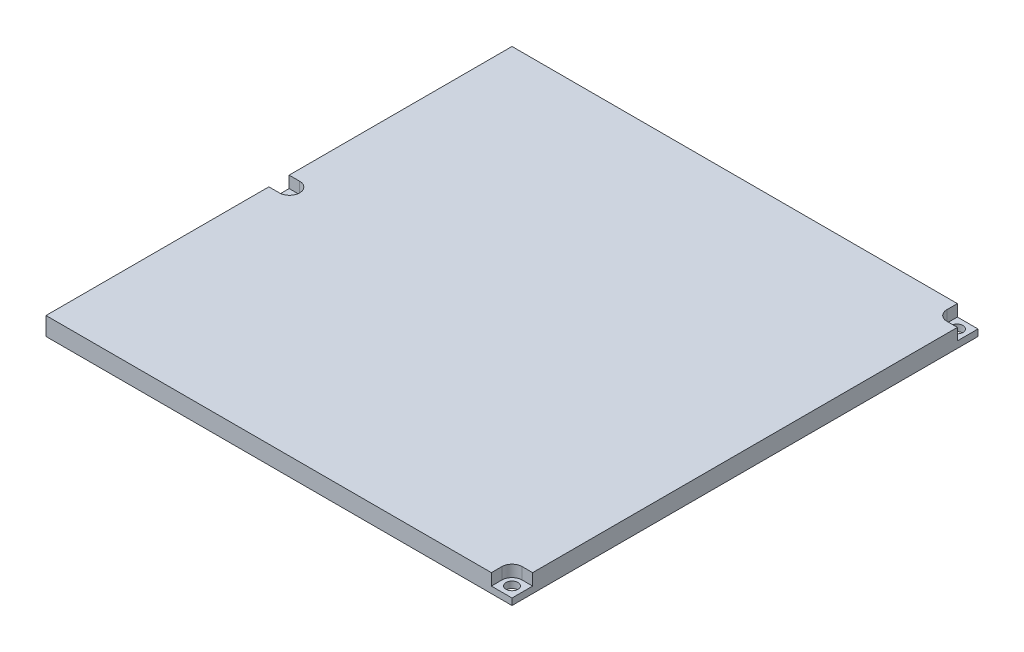
ISO-10303-21;
HEADER;
FILE_DESCRIPTION(('STEP AP214'),'2;1');
FILE_NAME('part.step','',(''),(''),'','','');
FILE_SCHEMA(('AUTOMOTIVE_DESIGN { 1 0 10303 214 1 1 1 1 }'));
ENDSEC;
DATA;
#1=APPLICATION_CONTEXT('core data for automotive mechanical design processes');
#2=APPLICATION_PROTOCOL_DEFINITION('international standard','automotive_design',2000,#1);
#3=PRODUCT_CONTEXT('',#1,'mechanical');
#4=PRODUCT('Part','Part','',(#3));
#5=PRODUCT_RELATED_PRODUCT_CATEGORY('part','',(#4));
#6=PRODUCT_DEFINITION_FORMATION('','',#4);
#7=PRODUCT_DEFINITION_CONTEXT('part definition',#1,'design');
#8=PRODUCT_DEFINITION('design','',#6,#7);
#9=PRODUCT_DEFINITION_SHAPE('','',#8);
#10=(LENGTH_UNIT() NAMED_UNIT(*) SI_UNIT(.MILLI.,.METRE.));
#11=(NAMED_UNIT(*) PLANE_ANGLE_UNIT() SI_UNIT($,.RADIAN.));
#12=(NAMED_UNIT(*) SI_UNIT($,.STERADIAN.) SOLID_ANGLE_UNIT());
#13=UNCERTAINTY_MEASURE_WITH_UNIT(LENGTH_MEASURE(1.E-05),#10,'distance_accuracy_value','');
#14=(GEOMETRIC_REPRESENTATION_CONTEXT(3) GLOBAL_UNCERTAINTY_ASSIGNED_CONTEXT((#13)) GLOBAL_UNIT_ASSIGNED_CONTEXT((#10,
#11,#12)) REPRESENTATION_CONTEXT('',''));
#15=CARTESIAN_POINT('',(0.,0.,0.));
#16=DIRECTION('',(0.,0.,1.));
#17=DIRECTION('',(1.,0.,0.));
#18=AXIS2_PLACEMENT_3D('',#15,#16,#17);
#19=CARTESIAN_POINT('',(4.57200000000001,-0.000999999999999265,-101.6));
#20=DIRECTION('',(0.,1.,0.));
#21=DIRECTION('',(0.,0.,1.));
#22=AXIS2_PLACEMENT_3D('',#19,#20,#21);
#23=CYLINDRICAL_SURFACE('',#22,2.60985);
#24=CARTESIAN_POINT('',(4.57200000000001,0.,-101.6));
#25=DIRECTION('',(0.,-1.,0.));
#26=DIRECTION('',(0.,0.,-1.));
#27=AXIS2_PLACEMENT_3D('',#24,#25,#26);
#28=CIRCLE('',#27,2.60985);
#29=CARTESIAN_POINT('',(4.57200000000001,0.,-104.20985));
#30=VERTEX_POINT('',#29);
#31=EDGE_CURVE('E256',#30,#30,#28,.F.);
#32=ORIENTED_EDGE('',*,*,#31,.F.);
#33=EDGE_LOOP('',(#32));
#34=FACE_BOUND('',#33,.T.);
#35=CARTESIAN_POINT('',(4.57200000000001,2.8575,-101.6));
#36=DIRECTION('',(0.,1.,0.));
#37=DIRECTION('',(0.,0.,1.));
#38=AXIS2_PLACEMENT_3D('',#35,#36,#37);
#39=CIRCLE('',#38,2.60984999999999);
#40=CARTESIAN_POINT('',(4.57200000000001,2.8575,-98.99015));
#41=VERTEX_POINT('',#40);
#42=EDGE_CURVE('E173',#41,#41,#39,.T.);
#43=ORIENTED_EDGE('',*,*,#42,.T.);
#44=EDGE_LOOP('',(#43));
#45=FACE_BOUND('',#44,.T.);
#46=ADVANCED_FACE('F34',(#34,#45),#23,.F.);
#47=CARTESIAN_POINT('',(198.628,-0.000999999999999265,-4.57200000000001));
#48=DIRECTION('',(0.,1.,0.));
#49=DIRECTION('',(0.,0.,1.));
#50=AXIS2_PLACEMENT_3D('',#47,#48,#49);
#51=CYLINDRICAL_SURFACE('',#50,2.60985);
#52=CARTESIAN_POINT('',(198.628,0.,-4.57200000000001));
#53=DIRECTION('',(0.,-1.,0.));
#54=DIRECTION('',(0.,0.,-1.));
#55=AXIS2_PLACEMENT_3D('',#52,#53,#54);
#56=CIRCLE('',#55,2.60985);
#57=CARTESIAN_POINT('',(198.628,0.,-7.18185000000001));
#58=VERTEX_POINT('',#57);
#59=EDGE_CURVE('E243',#58,#58,#56,.F.);
#60=ORIENTED_EDGE('',*,*,#59,.F.);
#61=EDGE_LOOP('',(#60));
#62=FACE_BOUND('',#61,.T.);
#63=CARTESIAN_POINT('',(198.628,2.8575,-4.57200000000001));
#64=DIRECTION('',(0.,1.,0.));
#65=DIRECTION('',(0.,0.,1.));
#66=AXIS2_PLACEMENT_3D('',#63,#64,#65);
#67=CIRCLE('',#66,2.60985);
#68=CARTESIAN_POINT('',(198.628,2.8575,-1.96215000000001));
#69=VERTEX_POINT('',#68);
#70=EDGE_CURVE('E181',#69,#69,#67,.T.);
#71=ORIENTED_EDGE('',*,*,#70,.T.);
#72=EDGE_LOOP('',(#71));
#73=FACE_BOUND('',#72,.T.);
#74=ADVANCED_FACE('F349',(#62,#73),#51,.F.);
#75=CARTESIAN_POINT('',(198.628,-0.000999999999999265,-198.628));
#76=DIRECTION('',(0.,1.,0.));
#77=DIRECTION('',(0.,0.,1.));
#78=AXIS2_PLACEMENT_3D('',#75,#76,#77);
#79=CYLINDRICAL_SURFACE('',#78,2.60985);
#80=CARTESIAN_POINT('',(198.628,0.,-198.628));
#81=DIRECTION('',(0.,-1.,0.));
#82=DIRECTION('',(0.,0.,-1.));
#83=AXIS2_PLACEMENT_3D('',#80,#81,#82);
#84=CIRCLE('',#83,2.60985);
#85=CARTESIAN_POINT('',(198.628,0.,-201.23785));
#86=VERTEX_POINT('',#85);
#87=EDGE_CURVE('E253',#86,#86,#84,.F.);
#88=ORIENTED_EDGE('',*,*,#87,.F.);
#89=EDGE_LOOP('',(#88));
#90=FACE_BOUND('',#89,.T.);
#91=CARTESIAN_POINT('',(198.628,2.8575,-198.628));
#92=DIRECTION('',(0.,1.,0.));
#93=DIRECTION('',(0.,0.,1.));
#94=AXIS2_PLACEMENT_3D('',#91,#92,#93);
#95=CIRCLE('',#94,2.60985);
#96=CARTESIAN_POINT('',(198.628,2.8575,-196.01815));
#97=VERTEX_POINT('',#96);
#98=EDGE_CURVE('E211',#97,#97,#95,.T.);
#99=ORIENTED_EDGE('',*,*,#98,.T.);
#100=EDGE_LOOP('',(#99));
#101=FACE_BOUND('',#100,.T.);
#102=ADVANCED_FACE('F355',(#90,#101),#79,.F.);
#103=CARTESIAN_POINT('',(0.,7.9375,0.));
#104=DIRECTION('',(1.,0.,0.));
#105=DIRECTION('',(0.,0.,-1.));
#106=AXIS2_PLACEMENT_3D('',#103,#104,#105);
#107=PLANE('',#106);
#108=DIRECTION('',(0.,0.,1.));
#109=VECTOR('',#108,1.);
#110=CARTESIAN_POINT('',(0.,7.9375,0.));
#111=LINE('',#110,#109);
#112=CARTESIAN_POINT('',(0.,7.9375,-97.1804));
#113=VERTEX_POINT('',#112);
#114=CARTESIAN_POINT('',(0.,7.9375,0.));
#115=VERTEX_POINT('',#114);
#116=EDGE_CURVE('E264',#113,#115,#111,.T.);
#117=ORIENTED_EDGE('',*,*,#116,.F.);
#118=DIRECTION('',(0.,1.,0.));
#119=VECTOR('',#118,1.);
#120=CARTESIAN_POINT('',(0.,2.8575,-97.1804));
#121=LINE('',#120,#119);
#122=CARTESIAN_POINT('',(0.,2.8575,-97.1804));
#123=VERTEX_POINT('',#122);
#124=EDGE_CURVE('E182',#123,#113,#121,.T.);
#125=ORIENTED_EDGE('',*,*,#124,.F.);
#126=DIRECTION('',(0.,0.,1.));
#127=VECTOR('',#126,1.);
#128=CARTESIAN_POINT('',(0.,2.8575,-106.0196));
#129=LINE('',#128,#127);
#130=CARTESIAN_POINT('',(0.,2.8575,-106.0196));
#131=VERTEX_POINT('',#130);
#132=EDGE_CURVE('E163',#131,#123,#129,.T.);
#133=ORIENTED_EDGE('',*,*,#132,.F.);
#134=DIRECTION('',(0.,1.,0.));
#135=VECTOR('',#134,1.);
#136=CARTESIAN_POINT('',(0.,2.8575,-106.0196));
#137=LINE('',#136,#135);
#138=CARTESIAN_POINT('',(0.,7.9375,-106.0196));
#139=VERTEX_POINT('',#138);
#140=EDGE_CURVE('E154',#131,#139,#137,.T.);
#141=ORIENTED_EDGE('',*,*,#140,.T.);
#142=CARTESIAN_POINT('',(0.,7.9375,-203.2));
#143=VERTEX_POINT('',#142);
#144=EDGE_CURVE('E260',#143,#139,#111,.T.);
#145=ORIENTED_EDGE('',*,*,#144,.F.);
#146=DIRECTION('',(0.,-1.,0.));
#147=VECTOR('',#146,1.);
#148=CARTESIAN_POINT('',(0.,7.9375,-203.2));
#149=LINE('',#148,#147);
#150=CARTESIAN_POINT('',(0.,0.,-203.2));
#151=VERTEX_POINT('',#150);
#152=EDGE_CURVE('E271',#143,#151,#149,.T.);
#153=ORIENTED_EDGE('',*,*,#152,.T.);
#154=DIRECTION('',(0.,0.,1.));
#155=VECTOR('',#154,1.);
#156=CARTESIAN_POINT('',(0.,0.,0.));
#157=LINE('',#156,#155);
#158=CARTESIAN_POINT('',(0.,0.,0.));
#159=VERTEX_POINT('',#158);
#160=EDGE_CURVE('E259',#151,#159,#157,.T.);
#161=ORIENTED_EDGE('',*,*,#160,.T.);
#162=DIRECTION('',(0.,-1.,0.));
#163=VECTOR('',#162,1.);
#164=CARTESIAN_POINT('',(0.,7.9375,0.));
#165=LINE('',#164,#163);
#166=EDGE_CURVE('E11',#115,#159,#165,.T.);
#167=ORIENTED_EDGE('',*,*,#166,.F.);
#168=EDGE_LOOP('',(#117,#125,#133,#141,#145,#153,#161,#167));
#169=FACE_BOUND('',#168,.T.);
#170=ADVANCED_FACE('F36',(#169),#107,.F.);
#171=CARTESIAN_POINT('',(0.,7.9375,0.));
#172=DIRECTION('',(0.,0.,-1.));
#173=DIRECTION('',(-1.,0.,0.));
#174=AXIS2_PLACEMENT_3D('',#171,#172,#173);
#175=PLANE('',#174);
#176=DIRECTION('',(1.,0.,0.));
#177=VECTOR('',#176,1.);
#178=CARTESIAN_POINT('',(194.2084,2.8575,0.));
#179=LINE('',#178,#177);
#180=CARTESIAN_POINT('',(194.2084,2.8575,0.));
#181=VERTEX_POINT('',#180);
#182=CARTESIAN_POINT('',(203.2,2.8575,0.));
#183=VERTEX_POINT('',#182);
#184=EDGE_CURVE('E201',#181,#183,#179,.T.);
#185=ORIENTED_EDGE('',*,*,#184,.F.);
#186=DIRECTION('',(0.,1.,0.));
#187=VECTOR('',#186,1.);
#188=CARTESIAN_POINT('',(194.2084,2.8575,0.));
#189=LINE('',#188,#187);
#190=CARTESIAN_POINT('',(194.2084,7.9375,0.));
#191=VERTEX_POINT('',#190);
#192=EDGE_CURVE('E208',#181,#191,#189,.T.);
#193=ORIENTED_EDGE('',*,*,#192,.T.);
#194=DIRECTION('',(1.,0.,0.));
#195=VECTOR('',#194,1.);
#196=CARTESIAN_POINT('',(0.,7.9375,0.));
#197=LINE('',#196,#195);
#198=EDGE_CURVE('E263',#115,#191,#197,.T.);
#199=ORIENTED_EDGE('',*,*,#198,.F.);
#200=ORIENTED_EDGE('',*,*,#166,.T.);
#201=DIRECTION('',(1.,0.,0.));
#202=VECTOR('',#201,1.);
#203=CARTESIAN_POINT('',(0.,0.,0.));
#204=LINE('',#203,#202);
#205=CARTESIAN_POINT('',(203.2,0.,0.));
#206=VERTEX_POINT('',#205);
#207=EDGE_CURVE('E274',#159,#206,#204,.T.);
#208=ORIENTED_EDGE('',*,*,#207,.T.);
#209=DIRECTION('',(0.,-1.,0.));
#210=VECTOR('',#209,1.);
#211=CARTESIAN_POINT('',(203.2,7.9375,0.));
#212=LINE('',#211,#210);
#213=EDGE_CURVE('E42',#183,#206,#212,.T.);
#214=ORIENTED_EDGE('',*,*,#213,.F.);
#215=EDGE_LOOP('',(#185,#193,#199,#200,#208,#214));
#216=FACE_BOUND('',#215,.T.);
#217=ADVANCED_FACE('F295',(#216),#175,.F.);
#218=CARTESIAN_POINT('',(203.2,7.9375,0.));
#219=DIRECTION('',(-1.,0.,0.));
#220=DIRECTION('',(0.,0.,1.));
#221=AXIS2_PLACEMENT_3D('',#218,#219,#220);
#222=PLANE('',#221);
#223=DIRECTION('',(0.,0.,-1.));
#224=VECTOR('',#223,1.);
#225=CARTESIAN_POINT('',(203.2,7.9375,0.));
#226=LINE('',#225,#224);
#227=CARTESIAN_POINT('',(203.2,7.9375,-8.99160000000001));
#228=VERTEX_POINT('',#227);
#229=CARTESIAN_POINT('',(203.2,7.9375,-194.2084));
#230=VERTEX_POINT('',#229);
#231=EDGE_CURVE('E267',#228,#230,#226,.T.);
#232=ORIENTED_EDGE('',*,*,#231,.F.);
#233=DIRECTION('',(0.,1.,0.));
#234=VECTOR('',#233,1.);
#235=CARTESIAN_POINT('',(203.2,2.8575,-8.99160000000001));
#236=LINE('',#235,#234);
#237=CARTESIAN_POINT('',(203.2,2.8575,-8.99160000000001));
#238=VERTEX_POINT('',#237);
#239=EDGE_CURVE('E57',#238,#228,#236,.T.);
#240=ORIENTED_EDGE('',*,*,#239,.F.);
#241=DIRECTION('',(0.,0.,-1.));
#242=VECTOR('',#241,1.);
#243=CARTESIAN_POINT('',(203.2,2.8575,0.));
#244=LINE('',#243,#242);
#245=EDGE_CURVE('E188',#183,#238,#244,.T.);
#246=ORIENTED_EDGE('',*,*,#245,.F.);
#247=ORIENTED_EDGE('',*,*,#213,.T.);
#248=DIRECTION('',(0.,0.,-1.));
#249=VECTOR('',#248,1.);
#250=CARTESIAN_POINT('',(203.2,0.,0.));
#251=LINE('',#250,#249);
#252=CARTESIAN_POINT('',(203.2,0.,-203.2));
#253=VERTEX_POINT('',#252);
#254=EDGE_CURVE('E277',#206,#253,#251,.T.);
#255=ORIENTED_EDGE('',*,*,#254,.T.);
#256=DIRECTION('',(0.,-1.,0.));
#257=VECTOR('',#256,1.);
#258=CARTESIAN_POINT('',(203.2,7.9375,-203.2));
#259=LINE('',#258,#257);
#260=CARTESIAN_POINT('',(203.2,2.8575,-203.2));
#261=VERTEX_POINT('',#260);
#262=EDGE_CURVE('E284',#261,#253,#259,.T.);
#263=ORIENTED_EDGE('',*,*,#262,.F.);
#264=DIRECTION('',(0.,0.,-1.));
#265=VECTOR('',#264,1.);
#266=CARTESIAN_POINT('',(203.2,2.8575,-203.2));
#267=LINE('',#266,#265);
#268=CARTESIAN_POINT('',(203.2,2.8575,-194.2084));
#269=VERTEX_POINT('',#268);
#270=EDGE_CURVE('E227',#269,#261,#267,.T.);
#271=ORIENTED_EDGE('',*,*,#270,.F.);
#272=DIRECTION('',(0.,1.,0.));
#273=VECTOR('',#272,1.);
#274=CARTESIAN_POINT('',(203.2,2.8575,-194.2084));
#275=LINE('',#274,#273);
#276=EDGE_CURVE('E246',#269,#230,#275,.T.);
#277=ORIENTED_EDGE('',*,*,#276,.T.);
#278=EDGE_LOOP('',(#232,#240,#246,#247,#255,#263,#271,#277));
#279=FACE_BOUND('',#278,.T.);
#280=ADVANCED_FACE('F289',(#279),#222,.F.);
#281=CARTESIAN_POINT('',(0.,7.9375,-203.2));
#282=DIRECTION('',(0.,0.,1.));
#283=DIRECTION('',(1.,0.,0.));
#284=AXIS2_PLACEMENT_3D('',#281,#282,#283);
#285=PLANE('',#284);
#286=DIRECTION('',(-1.,0.,0.));
#287=VECTOR('',#286,1.);
#288=CARTESIAN_POINT('',(0.,7.9375,-203.2));
#289=LINE('',#288,#287);
#290=CARTESIAN_POINT('',(194.2084,7.9375,-203.2));
#291=VERTEX_POINT('',#290);
#292=EDGE_CURVE('E269',#291,#143,#289,.T.);
#293=ORIENTED_EDGE('',*,*,#292,.F.);
#294=DIRECTION('',(0.,1.,0.));
#295=VECTOR('',#294,1.);
#296=CARTESIAN_POINT('',(194.2084,2.8575,-203.2));
#297=LINE('',#296,#295);
#298=CARTESIAN_POINT('',(194.2084,2.8575,-203.2));
#299=VERTEX_POINT('',#298);
#300=EDGE_CURVE('E244',#299,#291,#297,.T.);
#301=ORIENTED_EDGE('',*,*,#300,.F.);
#302=DIRECTION('',(-1.,0.,0.));
#303=VECTOR('',#302,1.);
#304=CARTESIAN_POINT('',(194.2084,2.8575,-203.2));
#305=LINE('',#304,#303);
#306=EDGE_CURVE('E229',#261,#299,#305,.T.);
#307=ORIENTED_EDGE('',*,*,#306,.F.);
#308=ORIENTED_EDGE('',*,*,#262,.T.);
#309=DIRECTION('',(-1.,0.,0.));
#310=VECTOR('',#309,1.);
#311=CARTESIAN_POINT('',(0.,0.,-203.2));
#312=LINE('',#311,#310);
#313=EDGE_CURVE('E280',#253,#151,#312,.T.);
#314=ORIENTED_EDGE('',*,*,#313,.T.);
#315=ORIENTED_EDGE('',*,*,#152,.F.);
#316=EDGE_LOOP('',(#293,#301,#307,#308,#314,#315));
#317=FACE_BOUND('',#316,.T.);
#318=ADVANCED_FACE('F304',(#317),#285,.F.);
#319=CARTESIAN_POINT('',(0.,7.9375,0.));
#320=DIRECTION('',(0.,-1.,0.));
#321=DIRECTION('',(0.,0.,-1.));
#322=AXIS2_PLACEMENT_3D('',#319,#320,#321);
#323=PLANE('',#322);
#324=CARTESIAN_POINT('',(4.57200000000001,7.9375,-101.6));
#325=DIRECTION('',(0.,1.,0.));
#326=DIRECTION('',(0.,0.,1.));
#327=AXIS2_PLACEMENT_3D('',#324,#325,#326);
#328=CIRCLE('',#327,4.4196);
#329=CARTESIAN_POINT('',(4.57200000000001,7.9375,-97.1804));
#330=VERTEX_POINT('',#329);
#331=CARTESIAN_POINT('',(4.57200000000001,7.9375,-106.0196));
#332=VERTEX_POINT('',#331);
#333=EDGE_CURVE('E49',#330,#332,#328,.T.);
#334=ORIENTED_EDGE('',*,*,#333,.F.);
#335=DIRECTION('',(1.,0.,0.));
#336=VECTOR('',#335,1.);
#337=CARTESIAN_POINT('',(4.57200000000001,7.9375,-97.1804));
#338=LINE('',#337,#336);
#339=EDGE_CURVE('E167',#113,#330,#338,.T.);
#340=ORIENTED_EDGE('',*,*,#339,.F.);
#341=ORIENTED_EDGE('',*,*,#116,.T.);
#342=ORIENTED_EDGE('',*,*,#198,.T.);
#343=DIRECTION('',(0.,0.,1.));
#344=VECTOR('',#343,1.);
#345=CARTESIAN_POINT('',(194.2084,7.9375,-4.57200000000001));
#346=LINE('',#345,#344);
#347=CARTESIAN_POINT('',(194.2084,7.9375,-4.57200000000001));
#348=VERTEX_POINT('',#347);
#349=EDGE_CURVE('E192',#348,#191,#346,.T.);
#350=ORIENTED_EDGE('',*,*,#349,.F.);
#351=CARTESIAN_POINT('',(198.628,7.9375,-4.57200000000001));
#352=DIRECTION('',(0.,1.,0.));
#353=DIRECTION('',(0.,0.,1.));
#354=AXIS2_PLACEMENT_3D('',#351,#352,#353);
#355=CIRCLE('',#354,4.41959999999998);
#356=CARTESIAN_POINT('',(198.628,7.9375,-8.99159999999999));
#357=VERTEX_POINT('',#356);
#358=EDGE_CURVE('E204',#357,#348,#355,.T.);
#359=ORIENTED_EDGE('',*,*,#358,.F.);
#360=DIRECTION('',(-1.,0.,0.));
#361=VECTOR('',#360,1.);
#362=CARTESIAN_POINT('',(198.628,7.9375,-8.99160000000001));
#363=LINE('',#362,#361);
#364=EDGE_CURVE('E187',#228,#357,#363,.T.);
#365=ORIENTED_EDGE('',*,*,#364,.F.);
#366=ORIENTED_EDGE('',*,*,#231,.T.);
#367=DIRECTION('',(1.,0.,0.));
#368=VECTOR('',#367,1.);
#369=CARTESIAN_POINT('',(198.628,7.9375,-194.2084));
#370=LINE('',#369,#368);
#371=CARTESIAN_POINT('',(198.628,7.9375,-194.2084));
#372=VERTEX_POINT('',#371);
#373=EDGE_CURVE('E236',#372,#230,#370,.T.);
#374=ORIENTED_EDGE('',*,*,#373,.F.);
#375=CARTESIAN_POINT('',(198.628,7.9375,-198.628));
#376=DIRECTION('',(0.,1.,0.));
#377=DIRECTION('',(0.,0.,1.));
#378=AXIS2_PLACEMENT_3D('',#375,#376,#377);
#379=CIRCLE('',#378,4.41960000000001);
#380=CARTESIAN_POINT('',(194.2084,7.9375,-198.628));
#381=VERTEX_POINT('',#380);
#382=EDGE_CURVE('E219',#381,#372,#379,.T.);
#383=ORIENTED_EDGE('',*,*,#382,.F.);
#384=DIRECTION('',(0.,0.,1.));
#385=VECTOR('',#384,1.);
#386=CARTESIAN_POINT('',(194.2084,7.9375,-198.628));
#387=LINE('',#386,#385);
#388=EDGE_CURVE('E224',#291,#381,#387,.T.);
#389=ORIENTED_EDGE('',*,*,#388,.F.);
#390=ORIENTED_EDGE('',*,*,#292,.T.);
#391=ORIENTED_EDGE('',*,*,#144,.T.);
#392=DIRECTION('',(-1.,0.,0.));
#393=VECTOR('',#392,1.);
#394=CARTESIAN_POINT('',(4.57200000000001,7.9375,-106.0196));
#395=LINE('',#394,#393);
#396=EDGE_CURVE('E170',#332,#139,#395,.T.);
#397=ORIENTED_EDGE('',*,*,#396,.F.);
#398=EDGE_LOOP('',(#334,#340,#341,#342,#350,#359,#365,#366,#374,#383,#389,#390,#391,#397));
#399=FACE_BOUND('',#398,.T.);
#400=ADVANCED_FACE('F310',(#399),#323,.F.);
#401=CARTESIAN_POINT('',(0.,0.,0.));
#402=DIRECTION('',(0.,-1.,0.));
#403=DIRECTION('',(0.,0.,-1.));
#404=AXIS2_PLACEMENT_3D('',#401,#402,#403);
#405=PLANE('',#404);
#406=ORIENTED_EDGE('',*,*,#59,.T.);
#407=EDGE_LOOP('',(#406));
#408=FACE_BOUND('',#407,.T.);
#409=ORIENTED_EDGE('',*,*,#87,.T.);
#410=EDGE_LOOP('',(#409));
#411=FACE_BOUND('',#410,.T.);
#412=ORIENTED_EDGE('',*,*,#31,.T.);
#413=EDGE_LOOP('',(#412));
#414=FACE_BOUND('',#413,.T.);
#415=ORIENTED_EDGE('',*,*,#160,.F.);
#416=ORIENTED_EDGE('',*,*,#313,.F.);
#417=ORIENTED_EDGE('',*,*,#254,.F.);
#418=ORIENTED_EDGE('',*,*,#207,.F.);
#419=EDGE_LOOP('',(#415,#416,#417,#418));
#420=FACE_BOUND('',#419,.T.);
#421=ADVANCED_FACE('F300',(#408,#411,#414,#420),#405,.T.);
#422=CARTESIAN_POINT('',(198.628,2.8575,-198.628));
#423=DIRECTION('',(0.,1.,0.));
#424=DIRECTION('',(0.,0.,1.));
#425=AXIS2_PLACEMENT_3D('',#422,#423,#424);
#426=CYLINDRICAL_SURFACE('',#425,4.41960000000001);
#427=ORIENTED_EDGE('',*,*,#382,.T.);
#428=DIRECTION('',(0.,1.,0.));
#429=VECTOR('',#428,1.);
#430=CARTESIAN_POINT('',(198.628,2.8575,-194.2084));
#431=LINE('',#430,#429);
#432=CARTESIAN_POINT('',(198.628,2.8575,-194.2084));
#433=VERTEX_POINT('',#432);
#434=EDGE_CURVE('E234',#433,#372,#431,.T.);
#435=ORIENTED_EDGE('',*,*,#434,.F.);
#436=CARTESIAN_POINT('',(198.628,2.8575,-198.628));
#437=DIRECTION('',(0.,1.,0.));
#438=DIRECTION('',(0.,0.,1.));
#439=AXIS2_PLACEMENT_3D('',#436,#437,#438);
#440=CIRCLE('',#439,4.41960000000001);
#441=CARTESIAN_POINT('',(194.2084,2.8575,-198.628));
#442=VERTEX_POINT('',#441);
#443=EDGE_CURVE('E220',#442,#433,#440,.T.);
#444=ORIENTED_EDGE('',*,*,#443,.F.);
#445=DIRECTION('',(0.,1.,0.));
#446=VECTOR('',#445,1.);
#447=CARTESIAN_POINT('',(194.2084,2.8575,-198.628));
#448=LINE('',#447,#446);
#449=EDGE_CURVE('E241',#442,#381,#448,.T.);
#450=ORIENTED_EDGE('',*,*,#449,.T.);
#451=EDGE_LOOP('',(#427,#435,#444,#450));
#452=FACE_BOUND('',#451,.T.);
#453=ADVANCED_FACE('F366',(#452),#426,.F.);
#454=CARTESIAN_POINT('',(194.2084,2.8575,-198.628));
#455=DIRECTION('',(-1.,0.,0.));
#456=DIRECTION('',(0.,0.,1.));
#457=AXIS2_PLACEMENT_3D('',#454,#455,#456);
#458=PLANE('',#457);
#459=ORIENTED_EDGE('',*,*,#388,.T.);
#460=ORIENTED_EDGE('',*,*,#449,.F.);
#461=DIRECTION('',(0.,0.,1.));
#462=VECTOR('',#461,1.);
#463=CARTESIAN_POINT('',(194.2084,2.8575,-198.628));
#464=LINE('',#463,#462);
#465=EDGE_CURVE('E231',#299,#442,#464,.T.);
#466=ORIENTED_EDGE('',*,*,#465,.F.);
#467=ORIENTED_EDGE('',*,*,#300,.T.);
#468=EDGE_LOOP('',(#459,#460,#466,#467));
#469=FACE_BOUND('',#468,.T.);
#470=ADVANCED_FACE('F316',(#469),#458,.F.);
#471=CARTESIAN_POINT('',(198.628,2.8575,-194.2084));
#472=DIRECTION('',(0.,0.,1.));
#473=DIRECTION('',(1.,0.,0.));
#474=AXIS2_PLACEMENT_3D('',#471,#472,#473);
#475=PLANE('',#474);
#476=ORIENTED_EDGE('',*,*,#373,.T.);
#477=ORIENTED_EDGE('',*,*,#276,.F.);
#478=DIRECTION('',(1.,0.,0.));
#479=VECTOR('',#478,1.);
#480=CARTESIAN_POINT('',(198.628,2.8575,-194.2084));
#481=LINE('',#480,#479);
#482=EDGE_CURVE('E223',#433,#269,#481,.T.);
#483=ORIENTED_EDGE('',*,*,#482,.F.);
#484=ORIENTED_EDGE('',*,*,#434,.T.);
#485=EDGE_LOOP('',(#476,#477,#483,#484));
#486=FACE_BOUND('',#485,.T.);
#487=ADVANCED_FACE('F323',(#486),#475,.F.);
#488=CARTESIAN_POINT('',(198.628,2.8575,-198.628));
#489=DIRECTION('',(0.,1.,0.));
#490=DIRECTION('',(0.,0.,1.));
#491=AXIS2_PLACEMENT_3D('',#488,#489,#490);
#492=PLANE('',#491);
#493=ORIENTED_EDGE('',*,*,#98,.F.);
#494=EDGE_LOOP('',(#493));
#495=FACE_BOUND('',#494,.T.);
#496=ORIENTED_EDGE('',*,*,#443,.T.);
#497=ORIENTED_EDGE('',*,*,#482,.T.);
#498=ORIENTED_EDGE('',*,*,#270,.T.);
#499=ORIENTED_EDGE('',*,*,#306,.T.);
#500=ORIENTED_EDGE('',*,*,#465,.T.);
#501=EDGE_LOOP('',(#496,#497,#498,#499,#500));
#502=FACE_BOUND('',#501,.T.);
#503=ADVANCED_FACE('F319',(#495,#502),#492,.T.);
#504=CARTESIAN_POINT('',(194.2084,2.8575,-4.57200000000001));
#505=DIRECTION('',(-1.,0.,0.));
#506=DIRECTION('',(0.,0.,1.));
#507=AXIS2_PLACEMENT_3D('',#504,#505,#506);
#508=PLANE('',#507);
#509=ORIENTED_EDGE('',*,*,#349,.T.);
#510=ORIENTED_EDGE('',*,*,#192,.F.);
#511=DIRECTION('',(0.,0.,1.));
#512=VECTOR('',#511,1.);
#513=CARTESIAN_POINT('',(194.2084,2.8575,-4.57200000000001));
#514=LINE('',#513,#512);
#515=CARTESIAN_POINT('',(194.2084,2.8575,-4.57200000000001));
#516=VERTEX_POINT('',#515);
#517=EDGE_CURVE('E198',#516,#181,#514,.T.);
#518=ORIENTED_EDGE('',*,*,#517,.F.);
#519=DIRECTION('',(0.,1.,0.));
#520=VECTOR('',#519,1.);
#521=CARTESIAN_POINT('',(194.2084,2.8575,-4.57200000000001));
#522=LINE('',#521,#520);
#523=EDGE_CURVE('E212',#516,#348,#522,.T.);
#524=ORIENTED_EDGE('',*,*,#523,.T.);
#525=EDGE_LOOP('',(#509,#510,#518,#524));
#526=FACE_BOUND('',#525,.T.);
#527=ADVANCED_FACE('F386',(#526),#508,.F.);
#528=CARTESIAN_POINT('',(198.628,2.8575,-4.57200000000001));
#529=DIRECTION('',(0.,1.,0.));
#530=DIRECTION('',(0.,0.,1.));
#531=AXIS2_PLACEMENT_3D('',#528,#529,#530);
#532=CYLINDRICAL_SURFACE('',#531,4.41959999999998);
#533=ORIENTED_EDGE('',*,*,#358,.T.);
#534=ORIENTED_EDGE('',*,*,#523,.F.);
#535=CARTESIAN_POINT('',(198.628,2.8575,-4.57200000000001));
#536=DIRECTION('',(0.,1.,0.));
#537=DIRECTION('',(0.,0.,1.));
#538=AXIS2_PLACEMENT_3D('',#535,#536,#537);
#539=CIRCLE('',#538,4.41959999999998);
#540=CARTESIAN_POINT('',(198.628,2.8575,-8.99159999999999));
#541=VERTEX_POINT('',#540);
#542=EDGE_CURVE('E195',#541,#516,#539,.T.);
#543=ORIENTED_EDGE('',*,*,#542,.F.);
#544=DIRECTION('',(0.,1.,0.));
#545=VECTOR('',#544,1.);
#546=CARTESIAN_POINT('',(198.628,2.8575,-8.99159999999999));
#547=LINE('',#546,#545);
#548=EDGE_CURVE('E214',#541,#357,#547,.T.);
#549=ORIENTED_EDGE('',*,*,#548,.T.);
#550=EDGE_LOOP('',(#533,#534,#543,#549));
#551=FACE_BOUND('',#550,.T.);
#552=ADVANCED_FACE('F330',(#551),#532,.F.);
#553=CARTESIAN_POINT('',(198.628,2.8575,-8.99160000000001));
#554=DIRECTION('',(0.,0.,-1.));
#555=DIRECTION('',(-1.,0.,0.));
#556=AXIS2_PLACEMENT_3D('',#553,#554,#555);
#557=PLANE('',#556);
#558=ORIENTED_EDGE('',*,*,#364,.T.);
#559=ORIENTED_EDGE('',*,*,#548,.F.);
#560=DIRECTION('',(-1.,0.,0.));
#561=VECTOR('',#560,1.);
#562=CARTESIAN_POINT('',(198.628,2.8575,-8.99160000000001));
#563=LINE('',#562,#561);
#564=EDGE_CURVE('E191',#238,#541,#563,.T.);
#565=ORIENTED_EDGE('',*,*,#564,.F.);
#566=ORIENTED_EDGE('',*,*,#239,.T.);
#567=EDGE_LOOP('',(#558,#559,#565,#566));
#568=FACE_BOUND('',#567,.T.);
#569=ADVANCED_FACE('F327',(#568),#557,.F.);
#570=CARTESIAN_POINT('',(198.628,2.8575,-4.57200000000001));
#571=DIRECTION('',(0.,1.,0.));
#572=DIRECTION('',(0.,0.,1.));
#573=AXIS2_PLACEMENT_3D('',#570,#571,#572);
#574=PLANE('',#573);
#575=ORIENTED_EDGE('',*,*,#70,.F.);
#576=EDGE_LOOP('',(#575));
#577=FACE_BOUND('',#576,.T.);
#578=ORIENTED_EDGE('',*,*,#245,.T.);
#579=ORIENTED_EDGE('',*,*,#564,.T.);
#580=ORIENTED_EDGE('',*,*,#542,.T.);
#581=ORIENTED_EDGE('',*,*,#517,.T.);
#582=ORIENTED_EDGE('',*,*,#184,.T.);
#583=EDGE_LOOP('',(#578,#579,#580,#581,#582));
#584=FACE_BOUND('',#583,.T.);
#585=ADVANCED_FACE('F333',(#577,#584),#574,.T.);
#586=CARTESIAN_POINT('',(4.57200000000001,2.8575,-101.6));
#587=DIRECTION('',(0.,1.,0.));
#588=DIRECTION('',(0.,0.,1.));
#589=AXIS2_PLACEMENT_3D('',#586,#587,#588);
#590=CYLINDRICAL_SURFACE('',#589,4.4196);
#591=ORIENTED_EDGE('',*,*,#333,.T.);
#592=DIRECTION('',(0.,1.,0.));
#593=VECTOR('',#592,1.);
#594=CARTESIAN_POINT('',(4.57200000000001,2.8575,-106.0196));
#595=LINE('',#594,#593);
#596=CARTESIAN_POINT('',(4.57200000000001,2.8575,-106.0196));
#597=VERTEX_POINT('',#596);
#598=EDGE_CURVE('E146',#597,#332,#595,.T.);
#599=ORIENTED_EDGE('',*,*,#598,.F.);
#600=CARTESIAN_POINT('',(4.57200000000001,2.8575,-101.6));
#601=DIRECTION('',(0.,1.,0.));
#602=DIRECTION('',(0.,0.,1.));
#603=AXIS2_PLACEMENT_3D('',#600,#601,#602);
#604=CIRCLE('',#603,4.4196);
#605=CARTESIAN_POINT('',(4.57200000000001,2.8575,-97.1804));
#606=VERTEX_POINT('',#605);
#607=EDGE_CURVE('E150',#606,#597,#604,.T.);
#608=ORIENTED_EDGE('',*,*,#607,.F.);
#609=DIRECTION('',(0.,1.,0.));
#610=VECTOR('',#609,1.);
#611=CARTESIAN_POINT('',(4.57200000000001,2.8575,-97.1804));
#612=LINE('',#611,#610);
#613=EDGE_CURVE('E179',#606,#330,#612,.T.);
#614=ORIENTED_EDGE('',*,*,#613,.T.);
#615=EDGE_LOOP('',(#591,#599,#608,#614));
#616=FACE_BOUND('',#615,.T.);
#617=ADVANCED_FACE('F148',(#616),#590,.F.);
#618=CARTESIAN_POINT('',(4.57200000000001,2.8575,-97.1804));
#619=DIRECTION('',(0.,0.,1.));
#620=DIRECTION('',(1.,0.,0.));
#621=AXIS2_PLACEMENT_3D('',#618,#619,#620);
#622=PLANE('',#621);
#623=ORIENTED_EDGE('',*,*,#339,.T.);
#624=ORIENTED_EDGE('',*,*,#613,.F.);
#625=DIRECTION('',(1.,0.,0.));
#626=VECTOR('',#625,1.);
#627=CARTESIAN_POINT('',(4.57200000000001,2.8575,-97.1804));
#628=LINE('',#627,#626);
#629=EDGE_CURVE('E155',#123,#606,#628,.T.);
#630=ORIENTED_EDGE('',*,*,#629,.F.);
#631=ORIENTED_EDGE('',*,*,#124,.T.);
#632=EDGE_LOOP('',(#623,#624,#630,#631));
#633=FACE_BOUND('',#632,.T.);
#634=ADVANCED_FACE('F338',(#633),#622,.F.);
#635=CARTESIAN_POINT('',(4.57200000000001,2.8575,-106.0196));
#636=DIRECTION('',(0.,0.,-1.));
#637=DIRECTION('',(-1.,0.,0.));
#638=AXIS2_PLACEMENT_3D('',#635,#636,#637);
#639=PLANE('',#638);
#640=ORIENTED_EDGE('',*,*,#396,.T.);
#641=ORIENTED_EDGE('',*,*,#140,.F.);
#642=DIRECTION('',(-1.,0.,0.));
#643=VECTOR('',#642,1.);
#644=CARTESIAN_POINT('',(4.57200000000001,2.8575,-106.0196));
#645=LINE('',#644,#643);
#646=EDGE_CURVE('E158',#597,#131,#645,.T.);
#647=ORIENTED_EDGE('',*,*,#646,.F.);
#648=ORIENTED_EDGE('',*,*,#598,.T.);
#649=EDGE_LOOP('',(#640,#641,#647,#648));
#650=FACE_BOUND('',#649,.T.);
#651=ADVANCED_FACE('F159',(#650),#639,.F.);
#652=CARTESIAN_POINT('',(4.57200000000001,2.8575,-101.6));
#653=DIRECTION('',(0.,1.,0.));
#654=DIRECTION('',(0.,0.,1.));
#655=AXIS2_PLACEMENT_3D('',#652,#653,#654);
#656=PLANE('',#655);
#657=ORIENTED_EDGE('',*,*,#42,.F.);
#658=EDGE_LOOP('',(#657));
#659=FACE_BOUND('',#658,.T.);
#660=ORIENTED_EDGE('',*,*,#607,.T.);
#661=ORIENTED_EDGE('',*,*,#646,.T.);
#662=ORIENTED_EDGE('',*,*,#132,.T.);
#663=ORIENTED_EDGE('',*,*,#629,.T.);
#664=EDGE_LOOP('',(#660,#661,#662,#663));
#665=FACE_BOUND('',#664,.T.);
#666=ADVANCED_FACE('F165',(#659,#665),#656,.T.);
#667=CLOSED_SHELL('',(#46,#74,#102,#170,#217,#280,#318,#400,#421,#453,#470,#487,#503,#527,#552,
#569,#585,#617,#634,#651,#666));
#668=MANIFOLD_SOLID_BREP('B2',#667);
#669=ADVANCED_BREP_SHAPE_REPRESENTATION('',(#18,#668),#14);
#670=SHAPE_DEFINITION_REPRESENTATION(#9,#669);
ENDSEC;
END-ISO-10303-21;
